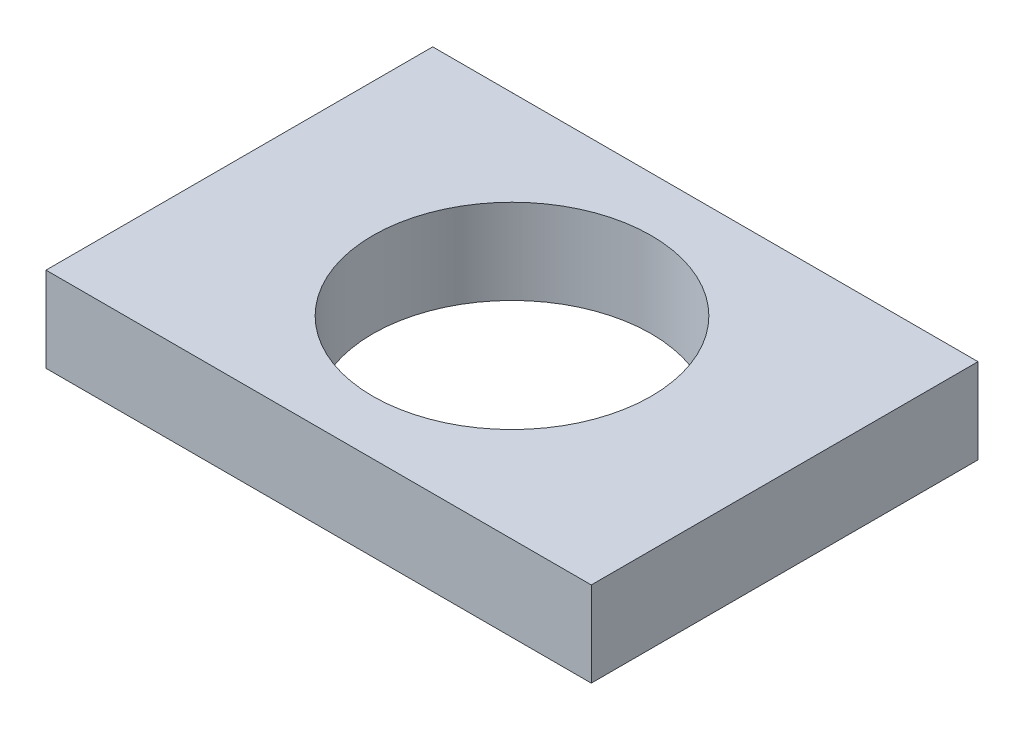
ISO-10303-21;
HEADER;
FILE_DESCRIPTION(('STEP AP214'),'2;1');
FILE_NAME('part.step','',(''),(''),'','','');
FILE_SCHEMA(('AUTOMOTIVE_DESIGN { 1 0 10303 214 1 1 1 1 }'));
ENDSEC;
DATA;
#1=APPLICATION_CONTEXT('core data for automotive mechanical design processes');
#2=APPLICATION_PROTOCOL_DEFINITION('international standard','automotive_design',2000,#1);
#3=PRODUCT_CONTEXT('',#1,'mechanical');
#4=PRODUCT('Part','Part','',(#3));
#5=PRODUCT_RELATED_PRODUCT_CATEGORY('part','',(#4));
#6=PRODUCT_DEFINITION_FORMATION('','',#4);
#7=PRODUCT_DEFINITION_CONTEXT('part definition',#1,'design');
#8=PRODUCT_DEFINITION('design','',#6,#7);
#9=PRODUCT_DEFINITION_SHAPE('','',#8);
#10=(LENGTH_UNIT() NAMED_UNIT(*) SI_UNIT(.MILLI.,.METRE.));
#11=(NAMED_UNIT(*) PLANE_ANGLE_UNIT() SI_UNIT($,.RADIAN.));
#12=(NAMED_UNIT(*) SI_UNIT($,.STERADIAN.) SOLID_ANGLE_UNIT());
#13=UNCERTAINTY_MEASURE_WITH_UNIT(LENGTH_MEASURE(1.E-05),#10,'distance_accuracy_value','');
#14=(GEOMETRIC_REPRESENTATION_CONTEXT(3) GLOBAL_UNCERTAINTY_ASSIGNED_CONTEXT((#13)) GLOBAL_UNIT_ASSIGNED_CONTEXT((#10,
#11,#12)) REPRESENTATION_CONTEXT('',''));
#15=CARTESIAN_POINT('',(0.,0.,0.));
#16=DIRECTION('',(0.,0.,1.));
#17=DIRECTION('',(1.,0.,0.));
#18=AXIS2_PLACEMENT_3D('',#15,#16,#17);
#19=CARTESIAN_POINT('',(10.575,3.3,-7.5));
#20=DIRECTION('',(-1.,0.,0.));
#21=DIRECTION('',(0.,0.,1.));
#22=AXIS2_PLACEMENT_3D('',#19,#20,#21);
#23=PLANE('',#22);
#24=DIRECTION('',(0.,0.,-1.));
#25=VECTOR('',#24,1.);
#26=CARTESIAN_POINT('',(10.575,0.,-7.5));
#27=LINE('',#26,#25);
#28=CARTESIAN_POINT('',(10.575,0.,7.5));
#29=VERTEX_POINT('',#28);
#30=CARTESIAN_POINT('',(10.575,0.,-7.5));
#31=VERTEX_POINT('',#30);
#32=EDGE_CURVE('E98',#29,#31,#27,.T.);
#33=ORIENTED_EDGE('',*,*,#32,.T.);
#34=DIRECTION('',(0.,-1.,0.));
#35=VECTOR('',#34,1.);
#36=CARTESIAN_POINT('',(10.575,3.3,-7.5));
#37=LINE('',#36,#35);
#38=CARTESIAN_POINT('',(10.575,3.3,-7.5));
#39=VERTEX_POINT('',#38);
#40=EDGE_CURVE('E11',#39,#31,#37,.T.);
#41=ORIENTED_EDGE('',*,*,#40,.F.);
#42=DIRECTION('',(0.,0.,-1.));
#43=VECTOR('',#42,1.);
#44=CARTESIAN_POINT('',(10.575,3.3,-7.5));
#45=LINE('',#44,#43);
#46=CARTESIAN_POINT('',(10.575,3.3,7.5));
#47=VERTEX_POINT('',#46);
#48=EDGE_CURVE('E85',#47,#39,#45,.T.);
#49=ORIENTED_EDGE('',*,*,#48,.F.);
#50=DIRECTION('',(0.,-1.,0.));
#51=VECTOR('',#50,1.);
#52=CARTESIAN_POINT('',(10.575,3.3,7.5));
#53=LINE('',#52,#51);
#54=EDGE_CURVE('E94',#47,#29,#53,.T.);
#55=ORIENTED_EDGE('',*,*,#54,.T.);
#56=EDGE_LOOP('',(#33,#41,#49,#55));
#57=FACE_BOUND('',#56,.T.);
#58=ADVANCED_FACE('F33',(#57),#23,.F.);
#59=CARTESIAN_POINT('',(-10.575,3.3,-7.5));
#60=DIRECTION('',(0.,0.,1.));
#61=DIRECTION('',(1.,0.,0.));
#62=AXIS2_PLACEMENT_3D('',#59,#60,#61);
#63=PLANE('',#62);
#64=DIRECTION('',(-1.,0.,0.));
#65=VECTOR('',#64,1.);
#66=CARTESIAN_POINT('',(-10.575,0.,-7.5));
#67=LINE('',#66,#65);
#68=CARTESIAN_POINT('',(-10.575,0.,-7.5));
#69=VERTEX_POINT('',#68);
#70=EDGE_CURVE('E89',#31,#69,#67,.T.);
#71=ORIENTED_EDGE('',*,*,#70,.T.);
#72=DIRECTION('',(0.,-1.,0.));
#73=VECTOR('',#72,1.);
#74=CARTESIAN_POINT('',(-10.575,3.3,-7.5));
#75=LINE('',#74,#73);
#76=CARTESIAN_POINT('',(-10.575,3.3,-7.5));
#77=VERTEX_POINT('',#76);
#78=EDGE_CURVE('E42',#77,#69,#75,.T.);
#79=ORIENTED_EDGE('',*,*,#78,.F.);
#80=DIRECTION('',(-1.,0.,0.));
#81=VECTOR('',#80,1.);
#82=CARTESIAN_POINT('',(-10.575,3.3,-7.5));
#83=LINE('',#82,#81);
#84=EDGE_CURVE('E80',#39,#77,#83,.T.);
#85=ORIENTED_EDGE('',*,*,#84,.F.);
#86=ORIENTED_EDGE('',*,*,#40,.T.);
#87=EDGE_LOOP('',(#71,#79,#85,#86));
#88=FACE_BOUND('',#87,.T.);
#89=ADVANCED_FACE('F88',(#88),#63,.F.);
#90=CARTESIAN_POINT('',(-10.575,3.3,-7.5));
#91=DIRECTION('',(1.,0.,0.));
#92=DIRECTION('',(0.,0.,-1.));
#93=AXIS2_PLACEMENT_3D('',#90,#91,#92);
#94=PLANE('',#93);
#95=DIRECTION('',(0.,0.,1.));
#96=VECTOR('',#95,1.);
#97=CARTESIAN_POINT('',(-10.575,0.,-7.5));
#98=LINE('',#97,#96);
#99=CARTESIAN_POINT('',(-10.575,0.,7.5));
#100=VERTEX_POINT('',#99);
#101=EDGE_CURVE('E67',#69,#100,#98,.T.);
#102=ORIENTED_EDGE('',*,*,#101,.T.);
#103=DIRECTION('',(0.,-1.,0.));
#104=VECTOR('',#103,1.);
#105=CARTESIAN_POINT('',(-10.575,3.3,7.5));
#106=LINE('',#105,#104);
#107=CARTESIAN_POINT('',(-10.575,3.3,7.5));
#108=VERTEX_POINT('',#107);
#109=EDGE_CURVE('E90',#108,#100,#106,.T.);
#110=ORIENTED_EDGE('',*,*,#109,.F.);
#111=DIRECTION('',(0.,0.,1.));
#112=VECTOR('',#111,1.);
#113=CARTESIAN_POINT('',(-10.575,3.3,-7.5));
#114=LINE('',#113,#112);
#115=EDGE_CURVE('E83',#77,#108,#114,.T.);
#116=ORIENTED_EDGE('',*,*,#115,.F.);
#117=ORIENTED_EDGE('',*,*,#78,.T.);
#118=EDGE_LOOP('',(#102,#110,#116,#117));
#119=FACE_BOUND('',#118,.T.);
#120=ADVANCED_FACE('F92',(#119),#94,.F.);
#121=CARTESIAN_POINT('',(-10.575,3.3,7.5));
#122=DIRECTION('',(0.,0.,-1.));
#123=DIRECTION('',(-1.,0.,0.));
#124=AXIS2_PLACEMENT_3D('',#121,#122,#123);
#125=PLANE('',#124);
#126=DIRECTION('',(1.,0.,0.));
#127=VECTOR('',#126,1.);
#128=CARTESIAN_POINT('',(-10.575,0.,7.5));
#129=LINE('',#128,#127);
#130=EDGE_CURVE('E73',#100,#29,#129,.T.);
#131=ORIENTED_EDGE('',*,*,#130,.T.);
#132=ORIENTED_EDGE('',*,*,#54,.F.);
#133=DIRECTION('',(1.,0.,0.));
#134=VECTOR('',#133,1.);
#135=CARTESIAN_POINT('',(-10.575,3.3,7.5));
#136=LINE('',#135,#134);
#137=EDGE_CURVE('E50',#108,#47,#136,.T.);
#138=ORIENTED_EDGE('',*,*,#137,.F.);
#139=ORIENTED_EDGE('',*,*,#109,.T.);
#140=EDGE_LOOP('',(#131,#132,#138,#139));
#141=FACE_BOUND('',#140,.T.);
#142=ADVANCED_FACE('F105',(#141),#125,.F.);
#143=CARTESIAN_POINT('',(0.,3.3,0.));
#144=DIRECTION('',(0.,1.,0.));
#145=DIRECTION('',(0.,0.,1.));
#146=AXIS2_PLACEMENT_3D('',#143,#144,#145);
#147=PLANE('',#146);
#148=CARTESIAN_POINT('',(0.,3.3,0.));
#149=DIRECTION('',(0.,1.,0.));
#150=DIRECTION('',(0.,0.,1.));
#151=AXIS2_PLACEMENT_3D('',#148,#149,#150);
#152=CIRCLE('',#151,5.4);
#153=CARTESIAN_POINT('',(0.,3.3,5.4));
#154=VERTEX_POINT('',#153);
#155=EDGE_CURVE('E111',#154,#154,#152,.T.);
#156=ORIENTED_EDGE('',*,*,#155,.F.);
#157=EDGE_LOOP('',(#156));
#158=FACE_BOUND('',#157,.T.);
#159=ORIENTED_EDGE('',*,*,#48,.T.);
#160=ORIENTED_EDGE('',*,*,#84,.T.);
#161=ORIENTED_EDGE('',*,*,#115,.T.);
#162=ORIENTED_EDGE('',*,*,#137,.T.);
#163=EDGE_LOOP('',(#159,#160,#161,#162));
#164=FACE_BOUND('',#163,.T.);
#165=ADVANCED_FACE('F81',(#158,#164),#147,.T.);
#166=CARTESIAN_POINT('',(0.,0.,0.));
#167=DIRECTION('',(0.,1.,0.));
#168=DIRECTION('',(0.,0.,1.));
#169=AXIS2_PLACEMENT_3D('',#166,#167,#168);
#170=PLANE('',#169);
#171=CARTESIAN_POINT('',(0.,0.,0.));
#172=DIRECTION('',(0.,1.,0.));
#173=DIRECTION('',(0.,0.,1.));
#174=AXIS2_PLACEMENT_3D('',#171,#172,#173);
#175=CIRCLE('',#174,5.4);
#176=CARTESIAN_POINT('',(0.,0.,5.4));
#177=VERTEX_POINT('',#176);
#178=EDGE_CURVE('E36',#177,#177,#175,.T.);
#179=ORIENTED_EDGE('',*,*,#178,.T.);
#180=EDGE_LOOP('',(#179));
#181=FACE_BOUND('',#180,.T.);
#182=ORIENTED_EDGE('',*,*,#32,.F.);
#183=ORIENTED_EDGE('',*,*,#130,.F.);
#184=ORIENTED_EDGE('',*,*,#101,.F.);
#185=ORIENTED_EDGE('',*,*,#70,.F.);
#186=EDGE_LOOP('',(#182,#183,#184,#185));
#187=FACE_BOUND('',#186,.T.);
#188=ADVANCED_FACE('F108',(#181,#187),#170,.F.);
#189=CARTESIAN_POINT('',(0.,-0.15,0.));
#190=DIRECTION('',(0.,1.,0.));
#191=DIRECTION('',(0.,0.,1.));
#192=AXIS2_PLACEMENT_3D('',#189,#190,#191);
#193=CYLINDRICAL_SURFACE('',#192,5.4);
#194=ORIENTED_EDGE('',*,*,#155,.T.);
#195=EDGE_LOOP('',(#194));
#196=FACE_BOUND('',#195,.T.);
#197=ORIENTED_EDGE('',*,*,#178,.F.);
#198=EDGE_LOOP('',(#197));
#199=FACE_BOUND('',#198,.T.);
#200=ADVANCED_FACE('F119',(#196,#199),#193,.F.);
#201=CLOSED_SHELL('',(#58,#89,#120,#142,#165,#188,#200));
#202=MANIFOLD_SOLID_BREP('B2',#201);
#203=ADVANCED_BREP_SHAPE_REPRESENTATION('',(#18,#202),#14);
#204=SHAPE_DEFINITION_REPRESENTATION(#9,#203);
ENDSEC;
END-ISO-10303-21;
